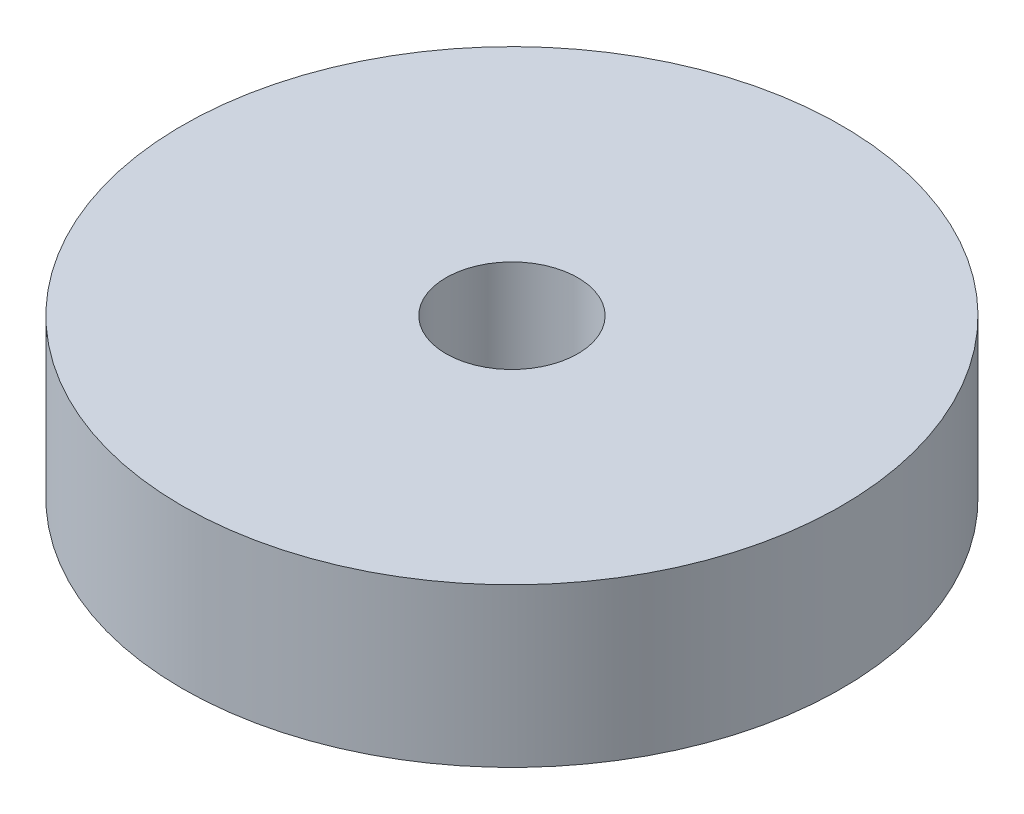
ISO-10303-21;
HEADER;
FILE_DESCRIPTION(('STEP AP214'),'2;1');
FILE_NAME('part.step','',(''),(''),'','','');
FILE_SCHEMA(('AUTOMOTIVE_DESIGN { 1 0 10303 214 1 1 1 1 }'));
ENDSEC;
DATA;
#1=APPLICATION_CONTEXT('core data for automotive mechanical design processes');
#2=APPLICATION_PROTOCOL_DEFINITION('international standard','automotive_design',2000,#1);
#3=PRODUCT_CONTEXT('',#1,'mechanical');
#4=PRODUCT('Part','Part','',(#3));
#5=PRODUCT_RELATED_PRODUCT_CATEGORY('part','',(#4));
#6=PRODUCT_DEFINITION_FORMATION('','',#4);
#7=PRODUCT_DEFINITION_CONTEXT('part definition',#1,'design');
#8=PRODUCT_DEFINITION('design','',#6,#7);
#9=PRODUCT_DEFINITION_SHAPE('','',#8);
#10=(LENGTH_UNIT() NAMED_UNIT(*) SI_UNIT(.MILLI.,.METRE.));
#11=(NAMED_UNIT(*) PLANE_ANGLE_UNIT() SI_UNIT($,.RADIAN.));
#12=(NAMED_UNIT(*) SI_UNIT($,.STERADIAN.) SOLID_ANGLE_UNIT());
#13=UNCERTAINTY_MEASURE_WITH_UNIT(LENGTH_MEASURE(1.E-05),#10,'distance_accuracy_value','');
#14=(GEOMETRIC_REPRESENTATION_CONTEXT(3) GLOBAL_UNCERTAINTY_ASSIGNED_CONTEXT((#13)) GLOBAL_UNIT_ASSIGNED_CONTEXT((#10,
#11,#12)) REPRESENTATION_CONTEXT('',''));
#15=CARTESIAN_POINT('',(0.,0.,0.));
#16=DIRECTION('',(0.,0.,1.));
#17=DIRECTION('',(1.,0.,0.));
#18=AXIS2_PLACEMENT_3D('',#15,#16,#17);
#19=CARTESIAN_POINT('',(0.,18.,0.));
#20=DIRECTION('',(0.,-1.,0.));
#21=DIRECTION('',(0.,0.,-1.));
#22=AXIS2_PLACEMENT_3D('',#19,#20,#21);
#23=CYLINDRICAL_SURFACE('',#22,37.5);
#24=CARTESIAN_POINT('',(0.,18.,0.));
#25=DIRECTION('',(0.,1.,0.));
#26=DIRECTION('',(0.,0.,1.));
#27=AXIS2_PLACEMENT_3D('',#24,#25,#26);
#28=CIRCLE('',#27,37.5);
#29=CARTESIAN_POINT('',(0.,18.,37.5));
#30=VERTEX_POINT('',#29);
#31=EDGE_CURVE('E10',#30,#30,#28,.T.);
#32=ORIENTED_EDGE('',*,*,#31,.F.);
#33=EDGE_LOOP('',(#32));
#34=FACE_BOUND('',#33,.T.);
#35=CARTESIAN_POINT('',(0.,0.,0.));
#36=DIRECTION('',(0.,1.,0.));
#37=DIRECTION('',(0.,0.,1.));
#38=AXIS2_PLACEMENT_3D('',#35,#36,#37);
#39=CIRCLE('',#38,37.5);
#40=CARTESIAN_POINT('',(0.,0.,37.5));
#41=VERTEX_POINT('',#40);
#42=EDGE_CURVE('E37',#41,#41,#39,.T.);
#43=ORIENTED_EDGE('',*,*,#42,.T.);
#44=EDGE_LOOP('',(#43));
#45=FACE_BOUND('',#44,.T.);
#46=ADVANCED_FACE('F40',(#34,#45),#23,.T.);
#47=CARTESIAN_POINT('',(0.,18.,0.));
#48=DIRECTION('',(0.,1.,0.));
#49=DIRECTION('',(0.,0.,1.));
#50=AXIS2_PLACEMENT_3D('',#47,#48,#49);
#51=PLANE('',#50);
#52=CARTESIAN_POINT('',(0.,18.,0.));
#53=DIRECTION('',(0.,1.,0.));
#54=DIRECTION('',(0.,0.,1.));
#55=AXIS2_PLACEMENT_3D('',#52,#53,#54);
#56=CIRCLE('',#55,7.5);
#57=CARTESIAN_POINT('',(0.,18.,7.5));
#58=VERTEX_POINT('',#57);
#59=EDGE_CURVE('E50',#58,#58,#56,.T.);
#60=ORIENTED_EDGE('',*,*,#59,.F.);
#61=EDGE_LOOP('',(#60));
#62=FACE_BOUND('',#61,.T.);
#63=ORIENTED_EDGE('',*,*,#31,.T.);
#64=EDGE_LOOP('',(#63));
#65=FACE_BOUND('',#64,.T.);
#66=ADVANCED_FACE('F59',(#62,#65),#51,.T.);
#67=CARTESIAN_POINT('',(0.,0.,0.));
#68=DIRECTION('',(0.,1.,0.));
#69=DIRECTION('',(0.,0.,1.));
#70=AXIS2_PLACEMENT_3D('',#67,#68,#69);
#71=PLANE('',#70);
#72=CARTESIAN_POINT('',(0.,0.,0.));
#73=DIRECTION('',(0.,1.,0.));
#74=DIRECTION('',(0.,0.,1.));
#75=AXIS2_PLACEMENT_3D('',#72,#73,#74);
#76=CIRCLE('',#75,7.5);
#77=CARTESIAN_POINT('',(0.,0.,7.5));
#78=VERTEX_POINT('',#77);
#79=EDGE_CURVE('E47',#78,#78,#76,.T.);
#80=ORIENTED_EDGE('',*,*,#79,.T.);
#81=EDGE_LOOP('',(#80));
#82=FACE_BOUND('',#81,.T.);
#83=ORIENTED_EDGE('',*,*,#42,.F.);
#84=EDGE_LOOP('',(#83));
#85=FACE_BOUND('',#84,.T.);
#86=ADVANCED_FACE('F58',(#82,#85),#71,.F.);
#87=CARTESIAN_POINT('',(0.,18.,0.));
#88=DIRECTION('',(0.,-1.,0.));
#89=DIRECTION('',(0.,0.,-1.));
#90=AXIS2_PLACEMENT_3D('',#87,#88,#89);
#91=CYLINDRICAL_SURFACE('',#90,7.5);
#92=ORIENTED_EDGE('',*,*,#59,.T.);
#93=EDGE_LOOP('',(#92));
#94=FACE_BOUND('',#93,.T.);
#95=ORIENTED_EDGE('',*,*,#79,.F.);
#96=EDGE_LOOP('',(#95));
#97=FACE_BOUND('',#96,.T.);
#98=ADVANCED_FACE('F54',(#94,#97),#91,.F.);
#99=CLOSED_SHELL('',(#46,#66,#86,#98));
#100=MANIFOLD_SOLID_BREP('B2',#99);
#101=ADVANCED_BREP_SHAPE_REPRESENTATION('',(#18,#100),#14);
#102=SHAPE_DEFINITION_REPRESENTATION(#9,#101);
ENDSEC;
END-ISO-10303-21;
